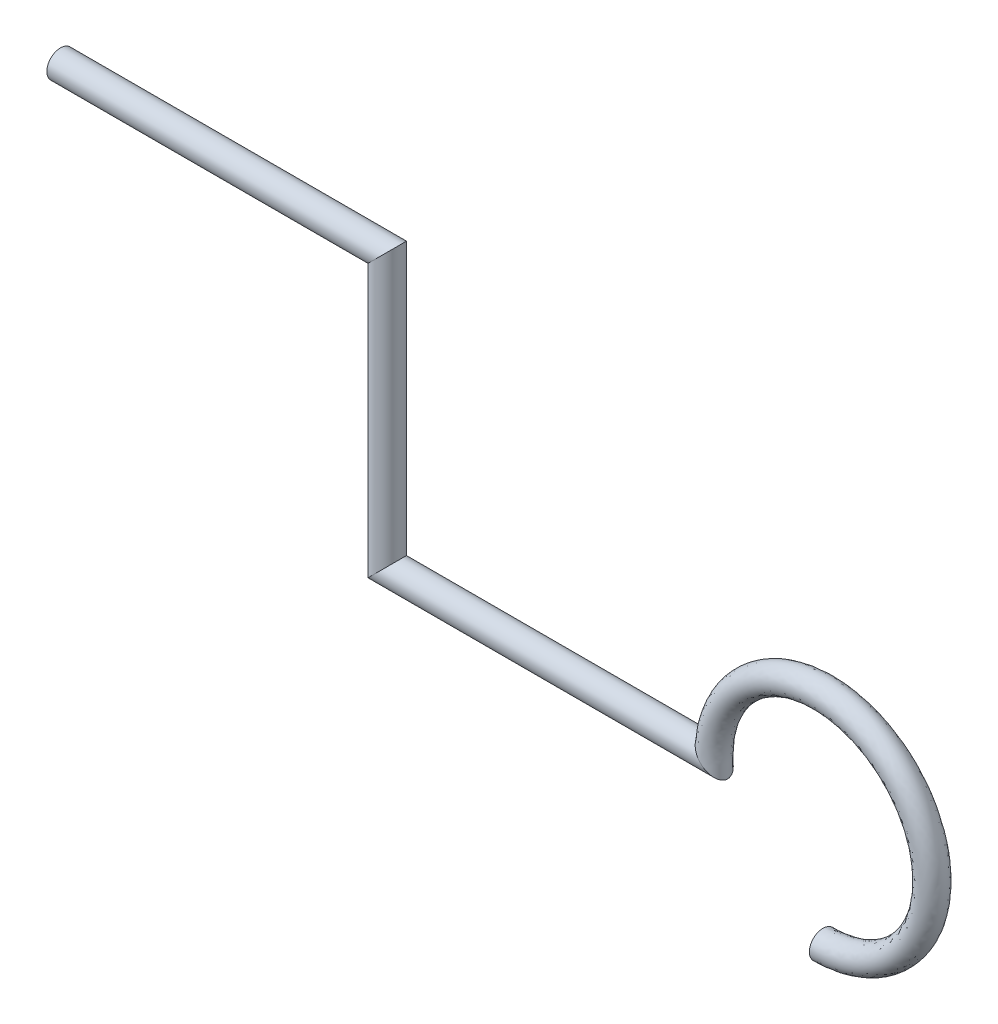
ISO-10303-21;
HEADER;
FILE_DESCRIPTION(('STEP AP214'),'2;1');
FILE_NAME('part.step','',(''),(''),'','','');
FILE_SCHEMA(('AUTOMOTIVE_DESIGN { 1 0 10303 214 1 1 1 1 }'));
ENDSEC;
DATA;
#1=APPLICATION_CONTEXT('core data for automotive mechanical design processes');
#2=APPLICATION_PROTOCOL_DEFINITION('international standard','automotive_design',2000,#1);
#3=PRODUCT_CONTEXT('',#1,'mechanical');
#4=PRODUCT('Part','Part','',(#3));
#5=PRODUCT_RELATED_PRODUCT_CATEGORY('part','',(#4));
#6=PRODUCT_DEFINITION_FORMATION('','',#4);
#7=PRODUCT_DEFINITION_CONTEXT('part definition',#1,'design');
#8=PRODUCT_DEFINITION('design','',#6,#7);
#9=PRODUCT_DEFINITION_SHAPE('','',#8);
#10=(LENGTH_UNIT() NAMED_UNIT(*) SI_UNIT(.MILLI.,.METRE.));
#11=(NAMED_UNIT(*) PLANE_ANGLE_UNIT() SI_UNIT($,.RADIAN.));
#12=(NAMED_UNIT(*) SI_UNIT($,.STERADIAN.) SOLID_ANGLE_UNIT());
#13=UNCERTAINTY_MEASURE_WITH_UNIT(LENGTH_MEASURE(1.E-05),#10,'distance_accuracy_value','');
#14=(GEOMETRIC_REPRESENTATION_CONTEXT(3) GLOBAL_UNCERTAINTY_ASSIGNED_CONTEXT((#13)) GLOBAL_UNIT_ASSIGNED_CONTEXT((#10,
#11,#12)) REPRESENTATION_CONTEXT('',''));
#15=CARTESIAN_POINT('',(0.,0.,0.));
#16=DIRECTION('',(0.,0.,1.));
#17=DIRECTION('',(1.,0.,0.));
#18=AXIS2_PLACEMENT_3D('',#15,#16,#17);
#19=CARTESIAN_POINT('',(0.,0.,0.));
#20=DIRECTION('',(1.,0.,0.));
#21=DIRECTION('',(0.,0.,-1.));
#22=AXIS2_PLACEMENT_3D('',#19,#20,#21);
#23=PLANE('',#22);
#24=CARTESIAN_POINT('',(0.,0.,0.));
#25=DIRECTION('',(1.,0.,0.));
#26=DIRECTION('',(0.,0.,-1.));
#27=AXIS2_PLACEMENT_3D('',#24,#25,#26);
#28=CIRCLE('',#27,0.5);
#29=CARTESIAN_POINT('',(0.,0.,-0.5));
#30=VERTEX_POINT('',#29);
#31=EDGE_CURVE('E41',#30,#30,#28,.T.);
#32=ORIENTED_EDGE('',*,*,#31,.F.);
#33=EDGE_LOOP('',(#32));
#34=FACE_BOUND('',#33,.T.);
#35=ADVANCED_FACE('F38',(#34),#23,.F.);
#36=CARTESIAN_POINT('',(28.,-14.,0.));
#37=DIRECTION('',(-1.,0.,0.));
#38=DIRECTION('',(0.,0.,-1.));
#39=AXIS2_PLACEMENT_3D('',#36,#37,#38);
#40=PLANE('',#39);
#41=CARTESIAN_POINT('',(28.,-14.,0.));
#42=DIRECTION('',(-1.,0.,0.));
#43=DIRECTION('',(0.,0.,-1.));
#44=AXIS2_PLACEMENT_3D('',#41,#42,#43);
#45=CIRCLE('',#44,0.5);
#46=CARTESIAN_POINT('',(28.,-14.,-0.5));
#47=VERTEX_POINT('',#46);
#48=EDGE_CURVE('E56',#47,#47,#45,.T.);
#49=ORIENTED_EDGE('',*,*,#48,.T.);
#50=EDGE_LOOP('',(#49));
#51=FACE_BOUND('',#50,.T.);
#52=ADVANCED_FACE('F112',(#51),#40,.T.);
#53=CARTESIAN_POINT('',(13.2,0.,0.));
#54=DIRECTION('',(-1.,0.,0.));
#55=DIRECTION('',(0.,0.,1.));
#56=AXIS2_PLACEMENT_3D('',#53,#54,#55);
#57=CYLINDRICAL_SURFACE('',#56,0.5);
#58=CARTESIAN_POINT('',(12.,0.,0.));
#59=DIRECTION('',(-0.707106781186548,0.707106781186547,0.));
#60=DIRECTION('',(0.707106781186547,0.707106781186548,0.));
#61=AXIS2_PLACEMENT_3D('',#58,#59,#60);
#62=ELLIPSE('',#61,0.707106781186547,0.5);
#63=CARTESIAN_POINT('',(12.5,0.5,0.));
#64=VERTEX_POINT('',#63);
#65=EDGE_CURVE('E67',#64,#64,#62,.T.);
#66=ORIENTED_EDGE('',*,*,#65,.T.);
#67=EDGE_LOOP('',(#66));
#68=FACE_BOUND('',#67,.T.);
#69=ORIENTED_EDGE('',*,*,#31,.T.);
#70=EDGE_LOOP('',(#69));
#71=FACE_BOUND('',#70,.T.);
#72=ADVANCED_FACE('F105',(#68,#71),#57,.T.);
#73=CARTESIAN_POINT('',(12.,-11.2,0.));
#74=DIRECTION('',(0.,1.,0.));
#75=DIRECTION('',(-1.,0.,0.));
#76=AXIS2_PLACEMENT_3D('',#73,#74,#75);
#77=CYLINDRICAL_SURFACE('',#76,0.5);
#78=CARTESIAN_POINT('',(12.,-10.,0.));
#79=DIRECTION('',(-0.707106781186548,0.707106781186547,0.));
#80=DIRECTION('',(-0.707106781186547,-0.707106781186548,0.));
#81=AXIS2_PLACEMENT_3D('',#78,#79,#80);
#82=ELLIPSE('',#81,0.707106781186547,0.5);
#83=CARTESIAN_POINT('',(11.5,-10.5,0.));
#84=VERTEX_POINT('',#83);
#85=EDGE_CURVE('E65',#84,#84,#82,.T.);
#86=ORIENTED_EDGE('',*,*,#85,.T.);
#87=EDGE_LOOP('',(#86));
#88=FACE_BOUND('',#87,.T.);
#89=ORIENTED_EDGE('',*,*,#65,.F.);
#90=EDGE_LOOP('',(#89));
#91=FACE_BOUND('',#90,.T.);
#92=ADVANCED_FACE('F61',(#88,#91),#77,.T.);
#93=CARTESIAN_POINT('',(25.2,-10.,0.));
#94=DIRECTION('',(-1.,0.,0.));
#95=DIRECTION('',(0.,0.,1.));
#96=AXIS2_PLACEMENT_3D('',#93,#94,#95);
#97=CYLINDRICAL_SURFACE('',#96,0.5);
#98=CARTESIAN_POINT('',(24.,-10.,-0.5));
#99=CARTESIAN_POINT('',(24.0010540113699,-10.0010540772711,-0.499999989438717));
#100=CARTESIAN_POINT('',(24.0021080758012,-10.0021082061689,-0.499996656778721));
#101=CARTESIAN_POINT('',(24.0415078497882,-10.0415103370149,-0.499747816691171));
#102=CARTESIAN_POINT('',(24.0799074010925,-10.0799103151917,-0.49510582063446));
#103=CARTESIAN_POINT('',(24.1557021215424,-10.155704470222,-0.476740714190235));
#104=CARTESIAN_POINT('',(24.1930951109051,-10.1930964644314,-0.462999323877264));
#105=CARTESIAN_POINT('',(24.2544015574081,-10.2544018786342,-0.431370992943008));
#106=CARTESIAN_POINT('',(24.2789652429522,-10.2789653280789,-0.416003172785721));
#107=CARTESIAN_POINT('',(24.3261345019605,-10.3261344170195,-0.380146503454197));
#108=CARTESIAN_POINT('',(24.3487443576661,-10.3487443380782,-0.359669256762966));
#109=CARTESIAN_POINT('',(24.3855274053597,-10.385527419898,-0.319234639164148));
#110=CARTESIAN_POINT('',(24.4003729241589,-10.4003729280248,-0.300504101668708));
#111=CARTESIAN_POINT('',(24.4278157424242,-10.4278157385594,-0.259945301837094));
#112=CARTESIAN_POINT('',(24.4404139058792,-10.4404139049509,-0.238118235770894));
#113=CARTESIAN_POINT('',(24.4603382034271,-10.4603382041641,-0.19624636404048));
#114=CARTESIAN_POINT('',(24.4682151274301,-10.4682151276244,-0.176728294378934));
#115=CARTESIAN_POINT('',(24.4815779822527,-10.4815779820588,-0.136150366290781));
#116=CARTESIAN_POINT('',(24.4870697094872,-10.4870697094462,-0.115094392494714));
#117=CARTESIAN_POINT('',(24.4953197039243,-10.4953197039908,-0.0717506211778777));
#118=CARTESIAN_POINT('',(24.498057193613,-10.4980571936327,-0.0494547799027981));
#119=CARTESIAN_POINT('',(24.5004843539305,-10.5004843539109,-0.00453390811768193));
#120=CARTESIAN_POINT('',(24.5001752501496,-10.5001752501376,0.0180909863629317));
#121=CARTESIAN_POINT('',(24.4967390667795,-10.4967390667902,0.0604414720434598));
#122=CARTESIAN_POINT('',(24.4939166413477,-10.4939166413726,0.0802185307352209));
#123=CARTESIAN_POINT('',(24.4860601638238,-10.4860601637989,0.118893153288375));
#124=CARTESIAN_POINT('',(24.4810229862282,-10.4810229861393,0.137789432343537));
#125=CARTESIAN_POINT('',(24.4687597500118,-10.4687597501047,0.175121925496947));
#126=CARTESIAN_POINT('',(24.4614460345226,-10.4614460348753,0.193499968165024));
#127=CARTESIAN_POINT('',(24.4450748480226,-10.4450748476692,0.228661012855192));
#128=CARTESIAN_POINT('',(24.436013686884,-10.4360136855619,0.245440525159257));
#129=CARTESIAN_POINT('',(24.4111479414547,-10.4111479434999,0.285992769358077));
#130=CARTESIAN_POINT('',(24.3943658077551,-10.3943658173273,0.308570490605411));
#131=CARTESIAN_POINT('',(24.358484466378,-10.3584844567944,0.349621329143569));
#132=CARTESIAN_POINT('',(24.3393822555316,-10.3393822192203,0.36808903688188));
#133=CARTESIAN_POINT('',(24.291010472853,-10.2910105247771,0.408266956814507));
#134=CARTESIAN_POINT('',(24.2609007156964,-10.2609009484469,0.42795720870889));
#135=CARTESIAN_POINT('',(24.1988707847447,-10.1988720184941,0.460079290209097));
#136=CARTESIAN_POINT('',(24.1669495936266,-10.1669516479112,0.472506995923344));
#137=CARTESIAN_POINT('',(24.0912927075523,-10.0912957178524,0.493636171672068));
#138=CARTESIAN_POINT('',(24.0471677849071,-10.0471706108872,0.499711991456944));
#139=CARTESIAN_POINT('',(24.0021080475449,-10.0021081779063,0.499996658834266));
#140=CARTESIAN_POINT('',(24.0010539826069,-10.0010540485019,0.499999991483602));
#141=CARTESIAN_POINT('',(24.,-10.,0.5));
#142=B_SPLINE_CURVE_WITH_KNOTS('',3,(#98,#99,#100,#101,#102,#103,#104,#105,#106,#107,#108,#109,
#110,#111,#112,#113,#114,#115,#116,#117,#118,#119,#120,#121,#122,#123,#124,#125,#126,#127,#128,
#129,#130,#131,#132,#133,#134,#135,#136,#137,#138,#139,#140,#141),.UNSPECIFIED.,.F.,.F.,(4,2,2,
2,2,2,2,2,2,2,2,2,2,2,2,2,2,2,2,2,2,4),(0.,0.00447214714129363,0.167157504901973,
0.330170679540015,0.443772104512988,0.557117874446858,0.641243981425062,0.725337676346146,
0.79249088677723,0.859479978260212,0.926970718395524,0.994434309316478,1.05468884411787,
1.11502868564986,1.17806150626214,1.24122892209686,1.33894736158732,1.43679366615546,
1.57671046034154,1.71670662647527,1.90339982388106,1.90787197102235),.UNSPECIFIED.);
#143=CARTESIAN_POINT('',(24.,-10.,0.5));
#144=VERTEX_POINT('',#143);
#145=CARTESIAN_POINT('',(24.,-10.,-0.5));
#146=VERTEX_POINT('',#145);
#147=EDGE_CURVE('E11',#144,#146,#142,.F.);
#148=ORIENTED_EDGE('',*,*,#147,.F.);
#149=CARTESIAN_POINT('',(24.,-10.,-0.5));
#150=CARTESIAN_POINT('',(23.9989459866192,-9.99894593170068,-0.499999990837819));
#151=CARTESIAN_POINT('',(23.997892130662,-9.99789159385158,-0.499996658124932));
#152=CARTESIAN_POINT('',(23.9598262586567,-9.95979293377491,-0.499755955484479));
#153=CARTESIAN_POINT('',(23.9230236504135,-9.92243318770094,-0.495413052716632));
#154=CARTESIAN_POINT('',(23.850855501836,-9.84820880579633,-0.477929081917609));
#155=CARTESIAN_POINT('',(23.8154924399325,-9.81134509141669,-0.46477346887435));
#156=CARTESIAN_POINT('',(23.7580293940457,-9.75075897467351,-0.434336670505023));
#157=CARTESIAN_POINT('',(23.7351913985214,-9.7264774791217,-0.419563123346557));
#158=CARTESIAN_POINT('',(23.691543557817,-9.67971204204076,-0.38504182601582));
#159=CARTESIAN_POINT('',(23.6707295965859,-9.65722446989393,-0.365304476475956));
#160=CARTESIAN_POINT('',(23.6363238669151,-9.61981920386924,-0.325623370557253));
#161=CARTESIAN_POINT('',(23.6221584702168,-9.60433393349502,-0.306715249872789));
#162=CARTESIAN_POINT('',(23.596127870264,-9.57575978140083,-0.265782517362425));
#163=CARTESIAN_POINT('',(23.5842578792737,-9.56266591495475,-0.243764561795113));
#164=CARTESIAN_POINT('',(23.565294626741,-9.54168245736477,-0.201015720218085));
#165=CARTESIAN_POINT('',(23.5577276951126,-9.53328186396404,-0.180747549082542));
#166=CARTESIAN_POINT('',(23.5449717549715,-9.51909522188251,-0.13864377734269));
#167=CARTESIAN_POINT('',(23.5397773564741,-9.51330324729286,-0.116811861262611));
#168=CARTESIAN_POINT('',(23.5320465986893,-9.50467566664414,-0.0719594324230994));
#169=CARTESIAN_POINT('',(23.5295268840099,-9.50185857388552,-0.0489324013562061));
#170=CARTESIAN_POINT('',(23.5273891878972,-9.49946892162031,-0.00257710363126123));
#171=CARTESIAN_POINT('',(23.5277703691804,-9.49989542591682,0.0207510741665314));
#172=CARTESIAN_POINT('',(23.5312367737421,-9.50376938062776,0.0648079614899384));
#173=CARTESIAN_POINT('',(23.5340756249866,-9.50694157981961,0.0855817106589942));
#174=CARTESIAN_POINT('',(23.5419622972636,-9.51573910587393,0.126189296076987));
#175=CARTESIAN_POINT('',(23.5470131524273,-9.52136780219392,0.146021799689546));
#176=CARTESIAN_POINT('',(23.5593032318151,-9.53503109004104,0.185063696307412));
#177=CARTESIAN_POINT('',(23.5666206890449,-9.54315157386916,0.204217932077549));
#178=CARTESIAN_POINT('',(23.5830468097289,-9.56132381323741,0.240794059407716));
#179=CARTESIAN_POINT('',(23.5921592341153,-9.57137962276465,0.258212195955953));
#180=CARTESIAN_POINT('',(23.6164385266855,-9.59807410244703,0.298812511683726));
#181=CARTESIAN_POINT('',(23.6324505638313,-9.61559969883839,0.320909538630598));
#182=CARTESIAN_POINT('',(23.6667977080487,-9.65295763096289,0.360993413924063));
#183=CARTESIAN_POINT('',(23.6851388515112,-9.67279594926136,0.378969228907621));
#184=CARTESIAN_POINT('',(23.7300719022875,-9.72104055240259,0.416420795301843));
#185=CARTESIAN_POINT('',(23.7573387535376,-9.75005489175388,0.434303074462212));
#186=CARTESIAN_POINT('',(23.8137266154986,-9.80945535519214,0.463454565622356));
#187=CARTESIAN_POINT('',(23.8428485122887,-9.83984213278972,0.474720590650995));
#188=CARTESIAN_POINT('',(23.9131733226026,-9.91241941223508,0.494175474209913));
#189=CARTESIAN_POINT('',(23.9548932894695,-9.95485557844744,0.499724594265501));
#190=CARTESIAN_POINT('',(23.9978921589559,-9.9978916256146,0.499996662536336));
#191=CARTESIAN_POINT('',(23.9989460154632,-9.99894596409462,0.499999995308282));
#192=CARTESIAN_POINT('',(24.,-10.,0.5));
#193=B_SPLINE_CURVE_WITH_KNOTS('',3,(#149,#150,#151,#152,#153,#154,#155,#156,#157,#158,#159,
#160,#161,#162,#163,#164,#165,#166,#167,#168,#169,#170,#171,#172,#173,#174,#175,#176,#177,#178,
#179,#180,#181,#182,#183,#184,#185,#186,#187,#188,#189,#190,#191,#192),.UNSPECIFIED.,.F.,.F.,(4,
2,2,2,2,2,2,2,2,2,2,2,2,2,2,2,2,2,2,2,2,4),(0.,0.00447214723702821,0.161562522218016,
0.318912809229694,0.427941291582922,0.536743203112152,0.621184799844452,0.705448323047896,
0.77478780959449,0.84396897557856,0.913578177717788,0.983167289369424,1.04649537163561,
1.10991059230661,1.17581913204554,1.2418672654287,1.33862268790662,1.43563419669668,
1.56585891179621,1.69614630325539,1.87416883964118,1.87864098687821),.UNSPECIFIED.);
#194=EDGE_CURVE('E46',#144,#146,#193,.F.);
#195=ORIENTED_EDGE('',*,*,#194,.T.);
#196=EDGE_LOOP('',(#148,#195));
#197=FACE_BOUND('',#196,.T.);
#198=ORIENTED_EDGE('',*,*,#85,.F.);
#199=EDGE_LOOP('',(#198));
#200=FACE_BOUND('',#199,.T.);
#201=ADVANCED_FACE('F58',(#197,#200),#97,.T.);
#202=CARTESIAN_POINT('',(28.,-14.,-0.5));
#203=CARTESIAN_POINT('',(28.7861071340401,-13.9999999993673,-0.5));
#204=CARTESIAN_POINT('',(29.5692468825495,-13.7622218509773,-0.5));
#205=CARTESIAN_POINT('',(30.8753149816074,-12.8895350474431,-0.5));
#206=CARTESIAN_POINT('',(31.3949595195747,-12.256346403151,-0.5));
#207=CARTESIAN_POINT('',(31.9960767405156,-10.8051210557697,-0.5));
#208=CARTESIAN_POINT('',(32.0763645724933,-9.98994501766839,-0.5));
#209=CARTESIAN_POINT('',(31.7699176707325,-8.44933240620259,-0.5));
#210=CARTESIAN_POINT('',(31.383787021819,-7.72693277232624,-0.5));
#211=CARTESIAN_POINT('',(30.2730672276734,-6.61621297818138,-0.5));
#212=CARTESIAN_POINT('',(29.5506675937974,-6.23008232926817,-0.5));
#213=CARTESIAN_POINT('',(28.0100549823316,-5.92363542750599,-0.5));
#214=CARTESIAN_POINT('',(27.1948789442283,-6.00392325948271,-0.5));
#215=CARTESIAN_POINT('',(25.743653596851,-6.60504048042699,-0.5));
#216=CARTESIAN_POINT('',(25.1104649525589,-7.12468501838967,-0.5));
#217=CARTESIAN_POINT('',(24.4559498499053,-8.10423609268755,-0.5));
#218=CARTESIAN_POINT('',(24.286332570692,-8.46283015987076,-0.5));
#219=CARTESIAN_POINT('',(24.1153025216926,-9.02651156906833,-0.5));
#220=CARTESIAN_POINT('',(24.0721492694408,-9.21862288185248,-0.5));
#221=CARTESIAN_POINT('',(24.0289133062412,-9.50998891727216,-0.5));
#222=CARTESIAN_POINT('',(24.0180782612807,-9.60764407307881,-0.5));
#223=CARTESIAN_POINT('',(24.0036217932001,-9.80351810601535,-0.5));
#224=CARTESIAN_POINT('',(24.0000061414421,-9.90173668908404,-0.5));
#225=CARTESIAN_POINT('',(23.9999937500201,-10.0999999195079,-0.5));
#226=CARTESIAN_POINT('',(24.,-10.1999999999999,-0.5));
#227=CARTESIAN_POINT('',(24.,-10.4000000000001,-0.5));
#228=CARTESIAN_POINT('',(24.,-10.5,-0.5));
#229=CARTESIAN_POINT('',(24.,-10.8,-0.5));
#230=CARTESIAN_POINT('',(24.,-11.0000000000004,-0.5));
#231=CARTESIAN_POINT('',(24.,-11.2,-0.5));
#232=CARTESIAN_POINT('',(28.,-15.,-0.5));
#233=CARTESIAN_POINT('',(28.9826339175478,-14.9999999992118,-0.5));
#234=CARTESIAN_POINT('',(29.9615586031865,-14.7027773137221,-0.5));
#235=CARTESIAN_POINT('',(31.5941437270095,-13.6119188093033,-0.5));
#236=CARTESIAN_POINT('',(32.2436993994677,-12.820433003939,-0.5));
#237=CARTESIAN_POINT('',(32.9950959256452,-11.0064013197119,-0.5));
#238=CARTESIAN_POINT('',(33.095455715616,-9.98743127208515,-0.5));
#239=CARTESIAN_POINT('',(32.7123970884163,-8.06166550775357,-0.5));
#240=CARTESIAN_POINT('',(32.229733777273,-7.15866596540754,-0.5));
#241=CARTESIAN_POINT('',(30.8413340345925,-5.77026622272698,-0.5));
#242=CARTESIAN_POINT('',(29.9383344922464,-5.28760291158504,-0.5));
#243=CARTESIAN_POINT('',(28.0125687279149,-4.90454428438265,-0.5));
#244=CARTESIAN_POINT('',(26.9935986802853,-5.00490407435347,-0.5));
#245=CARTESIAN_POINT('',(25.1795669960638,-5.75630060053366,-0.5));
#246=CARTESIAN_POINT('',(24.3880811906987,-6.40585627298718,-0.5));
#247=CARTESIAN_POINT('',(23.5699373123816,-7.6302951158594,-0.5));
#248=CARTESIAN_POINT('',(23.3579157133648,-8.0785376998387,-0.5));
#249=CARTESIAN_POINT('',(23.1441281521159,-8.78313946133529,-0.5));
#250=CARTESIAN_POINT('',(23.0901865868011,-9.02327860231568,-0.5));
#251=CARTESIAN_POINT('',(23.0361416328015,-9.38748614659015,-0.5));
#252=CARTESIAN_POINT('',(23.0225978266008,-9.50955509134852,-0.5));
#253=CARTESIAN_POINT('',(23.0045272415003,-9.75439763251919,-0.5));
#254=CARTESIAN_POINT('',(23.0000076768028,-9.88945378510634,-0.5));
#255=CARTESIAN_POINT('',(22.999992187525,-10.1124998993848,-0.5));
#256=CARTESIAN_POINT('',(23.,-10.1999999999999,-0.5));
#257=CARTESIAN_POINT('',(23.,-10.4000000000001,-0.5));
#258=CARTESIAN_POINT('',(23.,-10.5,-0.5));
#259=CARTESIAN_POINT('',(23.,-10.8,-0.5));
#260=CARTESIAN_POINT('',(23.,-11.0000000000004,-0.5));
#261=CARTESIAN_POINT('',(23.,-11.2,-0.5));
#262=CARTESIAN_POINT('',(28.,-15.,0.5));
#263=CARTESIAN_POINT('',(28.9826339175478,-14.9999999992118,0.5));
#264=CARTESIAN_POINT('',(29.9615586031865,-14.7027773137221,0.5));
#265=CARTESIAN_POINT('',(31.5941437270095,-13.6119188093033,0.5));
#266=CARTESIAN_POINT('',(32.2436993994677,-12.820433003939,0.5));
#267=CARTESIAN_POINT('',(32.9950959256452,-11.0064013197119,0.5));
#268=CARTESIAN_POINT('',(33.095455715616,-9.98743127208515,0.5));
#269=CARTESIAN_POINT('',(32.7123970884163,-8.06166550775357,0.5));
#270=CARTESIAN_POINT('',(32.229733777273,-7.15866596540754,0.5));
#271=CARTESIAN_POINT('',(30.8413340345925,-5.77026622272698,0.5));
#272=CARTESIAN_POINT('',(29.9383344922464,-5.28760291158504,0.5));
#273=CARTESIAN_POINT('',(28.0125687279149,-4.90454428438265,0.5));
#274=CARTESIAN_POINT('',(26.9935986802853,-5.00490407435347,0.5));
#275=CARTESIAN_POINT('',(25.1795669960638,-5.75630060053366,0.5));
#276=CARTESIAN_POINT('',(24.3880811906987,-6.40585627298718,0.5));
#277=CARTESIAN_POINT('',(23.5699373123816,-7.6302951158594,0.5));
#278=CARTESIAN_POINT('',(23.3579157133648,-8.0785376998387,0.5));
#279=CARTESIAN_POINT('',(23.1441281521159,-8.78313946133529,0.5));
#280=CARTESIAN_POINT('',(23.0901865868011,-9.02327860231568,0.5));
#281=CARTESIAN_POINT('',(23.0361416328015,-9.38748614659015,0.5));
#282=CARTESIAN_POINT('',(23.0225978266008,-9.50955509134852,0.5));
#283=CARTESIAN_POINT('',(23.0045272415003,-9.75439763251919,0.5));
#284=CARTESIAN_POINT('',(23.0000076768028,-9.88945378510634,0.5));
#285=CARTESIAN_POINT('',(22.999992187525,-10.1124998993848,0.5));
#286=CARTESIAN_POINT('',(23.,-10.1999999999999,0.5));
#287=CARTESIAN_POINT('',(23.,-10.4000000000001,0.5));
#288=CARTESIAN_POINT('',(23.,-10.5,0.5));
#289=CARTESIAN_POINT('',(23.,-10.8,0.5));
#290=CARTESIAN_POINT('',(23.,-11.0000000000004,0.5));
#291=CARTESIAN_POINT('',(23.,-11.2,0.5));
#292=CARTESIAN_POINT('',(28.,-14.,0.5));
#293=CARTESIAN_POINT('',(28.7861071340401,-13.9999999993673,0.5));
#294=CARTESIAN_POINT('',(29.5692468825495,-13.7622218509773,0.5));
#295=CARTESIAN_POINT('',(30.8753149816074,-12.8895350474431,0.5));
#296=CARTESIAN_POINT('',(31.3949595195747,-12.256346403151,0.5));
#297=CARTESIAN_POINT('',(31.9960767405156,-10.8051210557697,0.5));
#298=CARTESIAN_POINT('',(32.0763645724933,-9.98994501766839,0.5));
#299=CARTESIAN_POINT('',(31.7699176707325,-8.44933240620259,0.5));
#300=CARTESIAN_POINT('',(31.383787021819,-7.72693277232624,0.5));
#301=CARTESIAN_POINT('',(30.2730672276734,-6.61621297818138,0.5));
#302=CARTESIAN_POINT('',(29.5506675937974,-6.23008232926817,0.5));
#303=CARTESIAN_POINT('',(28.0100549823316,-5.92363542750599,0.5));
#304=CARTESIAN_POINT('',(27.1948789442283,-6.00392325948271,0.5));
#305=CARTESIAN_POINT('',(25.743653596851,-6.60504048042699,0.5));
#306=CARTESIAN_POINT('',(25.1104649525589,-7.12468501838967,0.5));
#307=CARTESIAN_POINT('',(24.4559498499053,-8.10423609268755,0.5));
#308=CARTESIAN_POINT('',(24.286332570692,-8.46283015987076,0.5));
#309=CARTESIAN_POINT('',(24.1153025216926,-9.02651156906833,0.5));
#310=CARTESIAN_POINT('',(24.0721492694408,-9.21862288185248,0.5));
#311=CARTESIAN_POINT('',(24.0289133062412,-9.50998891727216,0.5));
#312=CARTESIAN_POINT('',(24.0180782612807,-9.60764407307881,0.5));
#313=CARTESIAN_POINT('',(24.0036217932001,-9.80351810601535,0.5));
#314=CARTESIAN_POINT('',(24.0000061414421,-9.90173668908404,0.5));
#315=CARTESIAN_POINT('',(23.9999937500201,-10.0999999195079,0.5));
#316=CARTESIAN_POINT('',(24.,-10.1999999999999,0.5));
#317=CARTESIAN_POINT('',(24.,-10.4000000000001,0.5));
#318=CARTESIAN_POINT('',(24.,-10.5,0.5));
#319=CARTESIAN_POINT('',(24.,-10.8,0.5));
#320=CARTESIAN_POINT('',(24.,-11.0000000000004,0.5));
#321=CARTESIAN_POINT('',(24.,-11.2,0.5));
#322=CARTESIAN_POINT('',(28.,-13.,0.5));
#323=CARTESIAN_POINT('',(28.5895803505325,-12.9999999995227,0.5));
#324=CARTESIAN_POINT('',(29.1769351619124,-12.8216663882325,0.5));
#325=CARTESIAN_POINT('',(30.1564862362052,-12.1671512855828,0.5));
#326=CARTESIAN_POINT('',(30.5462196396817,-11.6922598023631,0.5));
#327=CARTESIAN_POINT('',(30.997057555386,-10.6038407918274,0.5));
#328=CARTESIAN_POINT('',(31.0572734293707,-9.99245876325164,0.5));
#329=CARTESIAN_POINT('',(30.8274382530487,-8.8369993046516,0.5));
#330=CARTESIAN_POINT('',(30.5378402663649,-8.29519957924493,0.5));
#331=CARTESIAN_POINT('',(29.7048004207544,-7.46215973363578,0.5));
#332=CARTESIAN_POINT('',(29.1630006953484,-7.1725617469513,0.5));
#333=CARTESIAN_POINT('',(28.0075412367484,-6.94272657062932,0.5));
#334=CARTESIAN_POINT('',(27.3961592081712,-7.00294244461195,0.5));
#335=CARTESIAN_POINT('',(26.3077401976383,-7.45378036032033,0.5));
#336=CARTESIAN_POINT('',(25.8328487144192,-7.84351376379217,0.5));
#337=CARTESIAN_POINT('',(25.3419623874289,-8.57817706951571,0.5));
#338=CARTESIAN_POINT('',(25.2147494280192,-8.84712261990281,0.5));
#339=CARTESIAN_POINT('',(25.0864768912694,-9.26988367680138,0.5));
#340=CARTESIAN_POINT('',(25.0541119520806,-9.41396716138927,0.5));
#341=CARTESIAN_POINT('',(25.0216849796809,-9.63249168795416,0.5));
#342=CARTESIAN_POINT('',(25.0135586959607,-9.70573305480911,0.5));
#343=CARTESIAN_POINT('',(25.0027163449,-9.85263857951151,0.5));
#344=CARTESIAN_POINT('',(25.0000046060815,-9.91401959306174,0.5));
#345=CARTESIAN_POINT('',(24.9999953125152,-10.0874999396309,0.5));
#346=CARTESIAN_POINT('',(25.,-10.1999999999999,0.5));
#347=CARTESIAN_POINT('',(25.,-10.4000000000001,0.5));
#348=CARTESIAN_POINT('',(25.,-10.5,0.5));
#349=CARTESIAN_POINT('',(25.,-10.8,0.5));
#350=CARTESIAN_POINT('',(25.,-11.0000000000004,0.5));
#351=CARTESIAN_POINT('',(25.,-11.2,0.5));
#352=CARTESIAN_POINT('',(28.,-13.,-0.5));
#353=CARTESIAN_POINT('',(28.5895803505325,-12.9999999995227,-0.5));
#354=CARTESIAN_POINT('',(29.1769351619124,-12.8216663882325,-0.5));
#355=CARTESIAN_POINT('',(30.1564862362052,-12.1671512855828,-0.5));
#356=CARTESIAN_POINT('',(30.5462196396817,-11.6922598023631,-0.5));
#357=CARTESIAN_POINT('',(30.997057555386,-10.6038407918274,-0.5));
#358=CARTESIAN_POINT('',(31.0572734293707,-9.99245876325164,-0.5));
#359=CARTESIAN_POINT('',(30.8274382530487,-8.8369993046516,-0.5));
#360=CARTESIAN_POINT('',(30.5378402663649,-8.29519957924493,-0.5));
#361=CARTESIAN_POINT('',(29.7048004207544,-7.46215973363578,-0.5));
#362=CARTESIAN_POINT('',(29.1630006953484,-7.1725617469513,-0.5));
#363=CARTESIAN_POINT('',(28.0075412367484,-6.94272657062932,-0.5));
#364=CARTESIAN_POINT('',(27.3961592081712,-7.00294244461195,-0.5));
#365=CARTESIAN_POINT('',(26.3077401976383,-7.45378036032033,-0.5));
#366=CARTESIAN_POINT('',(25.8328487144192,-7.84351376379217,-0.5));
#367=CARTESIAN_POINT('',(25.3419623874289,-8.57817706951571,-0.5));
#368=CARTESIAN_POINT('',(25.2147494280192,-8.84712261990281,-0.5));
#369=CARTESIAN_POINT('',(25.0864768912694,-9.26988367680138,-0.5));
#370=CARTESIAN_POINT('',(25.0541119520806,-9.41396716138927,-0.5));
#371=CARTESIAN_POINT('',(25.0216849796809,-9.63249168795416,-0.5));
#372=CARTESIAN_POINT('',(25.0135586959607,-9.70573305480911,-0.5));
#373=CARTESIAN_POINT('',(25.0027163449,-9.85263857951151,-0.5));
#374=CARTESIAN_POINT('',(25.0000046060815,-9.91401959306174,-0.5));
#375=CARTESIAN_POINT('',(24.9999953125152,-10.0874999396309,-0.5));
#376=CARTESIAN_POINT('',(25.,-10.1999999999999,-0.5));
#377=CARTESIAN_POINT('',(25.,-10.4000000000001,-0.5));
#378=CARTESIAN_POINT('',(25.,-10.5,-0.5));
#379=CARTESIAN_POINT('',(25.,-10.8,-0.5));
#380=CARTESIAN_POINT('',(25.,-11.0000000000004,-0.5));
#381=CARTESIAN_POINT('',(25.,-11.2,-0.5));
#382=CARTESIAN_POINT('',(28.,-14.,-0.5));
#383=CARTESIAN_POINT('',(28.7861071340401,-13.9999999993673,-0.5));
#384=CARTESIAN_POINT('',(29.5692468825495,-13.7622218509773,-0.5));
#385=CARTESIAN_POINT('',(30.8753149816074,-12.8895350474431,-0.5));
#386=CARTESIAN_POINT('',(31.3949595195747,-12.256346403151,-0.5));
#387=CARTESIAN_POINT('',(31.9960767405156,-10.8051210557697,-0.5));
#388=CARTESIAN_POINT('',(32.0763645724933,-9.98994501766839,-0.5));
#389=CARTESIAN_POINT('',(31.7699176707325,-8.44933240620259,-0.5));
#390=CARTESIAN_POINT('',(31.383787021819,-7.72693277232624,-0.5));
#391=CARTESIAN_POINT('',(30.2730672276734,-6.61621297818138,-0.5));
#392=CARTESIAN_POINT('',(29.5506675937974,-6.23008232926817,-0.5));
#393=CARTESIAN_POINT('',(28.0100549823316,-5.92363542750599,-0.5));
#394=CARTESIAN_POINT('',(27.1948789442283,-6.00392325948271,-0.5));
#395=CARTESIAN_POINT('',(25.743653596851,-6.60504048042699,-0.5));
#396=CARTESIAN_POINT('',(25.1104649525589,-7.12468501838967,-0.5));
#397=CARTESIAN_POINT('',(24.4559498499053,-8.10423609268755,-0.5));
#398=CARTESIAN_POINT('',(24.286332570692,-8.46283015987076,-0.5));
#399=CARTESIAN_POINT('',(24.1153025216926,-9.02651156906833,-0.5));
#400=CARTESIAN_POINT('',(24.0721492694408,-9.21862288185248,-0.5));
#401=CARTESIAN_POINT('',(24.0289133062412,-9.50998891727216,-0.5));
#402=CARTESIAN_POINT('',(24.0180782612807,-9.60764407307881,-0.5));
#403=CARTESIAN_POINT('',(24.0036217932001,-9.80351810601535,-0.5));
#404=CARTESIAN_POINT('',(24.0000061414421,-9.90173668908404,-0.5));
#405=CARTESIAN_POINT('',(23.9999937500201,-10.0999999195079,-0.5));
#406=CARTESIAN_POINT('',(24.,-10.1999999999999,-0.5));
#407=CARTESIAN_POINT('',(24.,-10.4000000000001,-0.5));
#408=CARTESIAN_POINT('',(24.,-10.5,-0.5));
#409=CARTESIAN_POINT('',(24.,-10.8,-0.5));
#410=CARTESIAN_POINT('',(24.,-11.0000000000004,-0.5));
#411=CARTESIAN_POINT('',(24.,-11.2,-0.5));
#412=(BOUNDED_SURFACE() B_SPLINE_SURFACE(3,3,((#202,#203,#204,#205,#206,#207,#208,#209,#210,
#211,#212,#213,#214,#215,#216,#217,#218,#219,#220,#221,#222,#223,#224,#225,#226,#227,#228,#229,
#230,#231),(#232,#233,#234,#235,#236,#237,#238,#239,#240,#241,#242,#243,#244,#245,#246,#247,
#248,#249,#250,#251,#252,#253,#254,#255,#256,#257,#258,#259,#260,#261),(#262,#263,#264,#265,
#266,#267,#268,#269,#270,#271,#272,#273,#274,#275,#276,#277,#278,#279,#280,#281,#282,#283,#284,
#285,#286,#287,#288,#289,#290,#291),(#292,#293,#294,#295,#296,#297,#298,#299,#300,#301,#302,
#303,#304,#305,#306,#307,#308,#309,#310,#311,#312,#313,#314,#315,#316,#317,#318,#319,#320,#321),
(#322,#323,#324,#325,#326,#327,#328,#329,#330,#331,#332,#333,#334,#335,#336,#337,#338,#339,#340,
#341,#342,#343,#344,#345,#346,#347,#348,#349,#350,#351),(#352,#353,#354,#355,#356,#357,#358,
#359,#360,#361,#362,#363,#364,#365,#366,#367,#368,#369,#370,#371,#372,#373,#374,#375,#376,#377,
#378,#379,#380,#381),(#382,#383,#384,#385,#386,#387,#388,#389,#390,#391,#392,#393,#394,#395,
#396,#397,#398,#399,#400,#401,#402,#403,#404,#405,#406,#407,#408,#409,#410,#411)),.UNSPECIFIED.,
.T.,.F.,.F.) B_SPLINE_SURFACE_WITH_KNOTS((4,3,4),(4,2,2,2,2,2,2,2,2,2,2,2,2,2,4),(0.,0.5,1.),
(0.,0.125,0.25,0.375,0.5,0.625,0.75,0.875,0.9375,0.96875,0.984375,1.,1.01590114079961,
1.03180228159922,1.06360456319843),
.UNSPECIFIED.) GEOMETRIC_REPRESENTATION_ITEM() RATIONAL_B_SPLINE_SURFACE(((1.,1.,1.,1.,1.,1.,1.,
1.,1.,1.,1.,1.,1.,1.,1.,1.,1.,1.,1.,1.,1.,1.,1.,1.,1.,1.,1.,1.,1.,1.),(0.333333333333333,
0.333333333333333,0.333333333333333,0.333333333333333,0.333333333333333,0.333333333333333,
0.333333333333333,0.333333333333333,0.333333333333333,0.333333333333333,0.333333333333333,
0.333333333333333,0.333333333333333,0.333333333333333,0.333333333333333,0.333333333333333,
0.333333333333333,0.333333333333333,0.333333333333333,0.333333333333333,0.333333333333333,
0.333333333333333,0.333333333333333,0.333333333333333,0.333333333333333,0.333333333333333,
0.333333333333333,0.333333333333333,0.333333333333333,0.333333333333333),(0.333333333333333,
0.333333333333333,0.333333333333333,0.333333333333333,0.333333333333333,0.333333333333333,
0.333333333333333,0.333333333333333,0.333333333333333,0.333333333333333,0.333333333333333,
0.333333333333333,0.333333333333333,0.333333333333333,0.333333333333333,0.333333333333333,
0.333333333333333,0.333333333333333,0.333333333333333,0.333333333333333,0.333333333333333,
0.333333333333333,0.333333333333333,0.333333333333333,0.333333333333333,0.333333333333333,
0.333333333333333,0.333333333333333,0.333333333333333,0.333333333333333),(1.,1.,1.,1.,1.,1.,1.,
1.,1.,1.,1.,1.,1.,1.,1.,1.,1.,1.,1.,1.,1.,1.,1.,1.,1.,1.,1.,1.,1.,1.),(0.333333333333333,
0.333333333333333,0.333333333333333,0.333333333333333,0.333333333333333,0.333333333333333,
0.333333333333333,0.333333333333333,0.333333333333333,0.333333333333333,0.333333333333333,
0.333333333333333,0.333333333333333,0.333333333333333,0.333333333333333,0.333333333333333,
0.333333333333333,0.333333333333333,0.333333333333333,0.333333333333333,0.333333333333333,
0.333333333333333,0.333333333333333,0.333333333333333,0.333333333333333,0.333333333333333,
0.333333333333333,0.333333333333333,0.333333333333333,0.333333333333333),(0.333333333333333,
0.333333333333333,0.333333333333333,0.333333333333333,0.333333333333333,0.333333333333333,
0.333333333333333,0.333333333333333,0.333333333333333,0.333333333333333,0.333333333333333,
0.333333333333333,0.333333333333333,0.333333333333333,0.333333333333333,0.333333333333333,
0.333333333333333,0.333333333333333,0.333333333333333,0.333333333333333,0.333333333333333,
0.333333333333333,0.333333333333333,0.333333333333333,0.333333333333333,0.333333333333333,
0.333333333333333,0.333333333333333,0.333333333333333,0.333333333333333),(1.,1.,1.,1.,1.,1.,1.,
1.,1.,1.,1.,1.,1.,1.,1.,1.,1.,1.,1.,1.,1.,1.,1.,1.,1.,1.,1.,1.,1.,1.))) REPRESENTATION_ITEM('') SURFACE());
#413=ORIENTED_EDGE('',*,*,#147,.T.);
#414=ORIENTED_EDGE('',*,*,#194,.F.);
#415=EDGE_LOOP('',(#413,#414));
#416=FACE_BOUND('',#415,.T.);
#417=ORIENTED_EDGE('',*,*,#48,.F.);
#418=EDGE_LOOP('',(#417));
#419=FACE_BOUND('',#418,.T.);
#420=ADVANCED_FACE('F53',(#416,#419),#412,.F.);
#421=CLOSED_SHELL('',(#35,#52,#72,#92,#201,#420));
#422=MANIFOLD_SOLID_BREP('B2',#421);
#423=ADVANCED_BREP_SHAPE_REPRESENTATION('',(#18,#422),#14);
#424=SHAPE_DEFINITION_REPRESENTATION(#9,#423);
ENDSEC;
END-ISO-10303-21;
